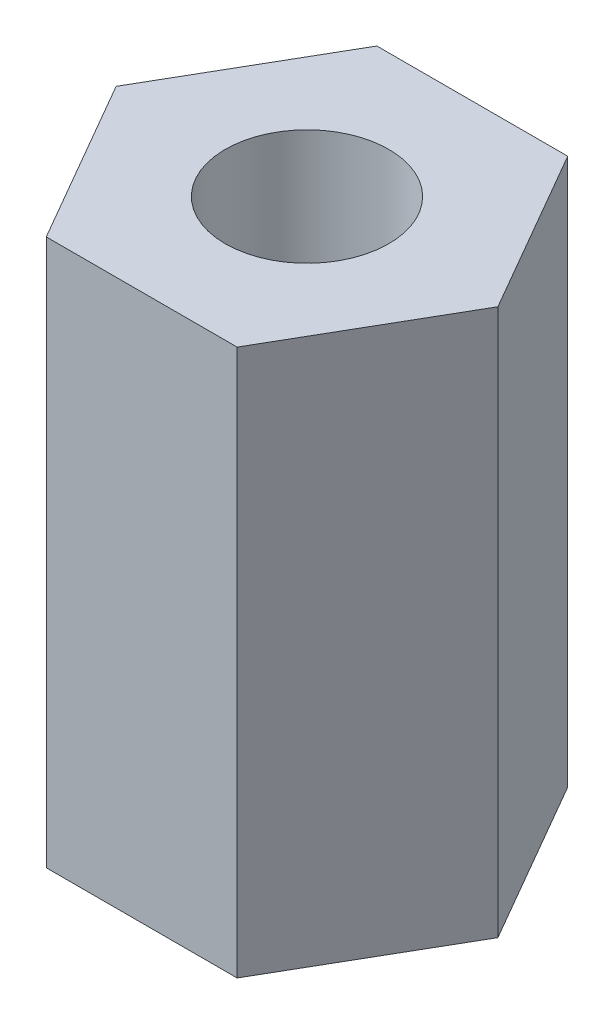
ISO-10303-21;
HEADER;
FILE_DESCRIPTION(('STEP AP214'),'2;1');
FILE_NAME('part.step','',(''),(''),'','','');
FILE_SCHEMA(('AUTOMOTIVE_DESIGN { 1 0 10303 214 1 1 1 1 }'));
ENDSEC;
DATA;
#1=APPLICATION_CONTEXT('core data for automotive mechanical design processes');
#2=APPLICATION_PROTOCOL_DEFINITION('international standard','automotive_design',2000,#1);
#3=PRODUCT_CONTEXT('',#1,'mechanical');
#4=PRODUCT('Part','Part','',(#3));
#5=PRODUCT_RELATED_PRODUCT_CATEGORY('part','',(#4));
#6=PRODUCT_DEFINITION_FORMATION('','',#4);
#7=PRODUCT_DEFINITION_CONTEXT('part definition',#1,'design');
#8=PRODUCT_DEFINITION('design','',#6,#7);
#9=PRODUCT_DEFINITION_SHAPE('','',#8);
#10=(LENGTH_UNIT() NAMED_UNIT(*) SI_UNIT(.MILLI.,.METRE.));
#11=(NAMED_UNIT(*) PLANE_ANGLE_UNIT() SI_UNIT($,.RADIAN.));
#12=(NAMED_UNIT(*) SI_UNIT($,.STERADIAN.) SOLID_ANGLE_UNIT());
#13=UNCERTAINTY_MEASURE_WITH_UNIT(LENGTH_MEASURE(1.E-05),#10,'distance_accuracy_value','');
#14=(GEOMETRIC_REPRESENTATION_CONTEXT(3) GLOBAL_UNCERTAINTY_ASSIGNED_CONTEXT((#13)) GLOBAL_UNIT_ASSIGNED_CONTEXT((#10,
#11,#12)) REPRESENTATION_CONTEXT('',''));
#15=CARTESIAN_POINT('',(0.,0.,0.));
#16=DIRECTION('',(0.,0.,1.));
#17=DIRECTION('',(1.,0.,0.));
#18=AXIS2_PLACEMENT_3D('',#15,#16,#17);
#19=CARTESIAN_POINT('',(0.,9.9695,0.));
#20=DIRECTION('',(0.,1.,0.));
#21=DIRECTION('',(0.,0.,1.));
#22=AXIS2_PLACEMENT_3D('',#19,#20,#21);
#23=PLANE('',#22);
#24=DIRECTION('',(0.5,0.,-0.866025403784439));
#25=VECTOR('',#24,1.);
#26=CARTESIAN_POINT('',(3.48286549888642,9.9695,6.0325));
#27=LINE('',#26,#25);
#28=CARTESIAN_POINT('',(3.48286549888642,9.9695,6.0325));
#29=VERTEX_POINT('',#28);
#30=CARTESIAN_POINT('',(6.96573099777284,9.9695,0.));
#31=VERTEX_POINT('',#30);
#32=EDGE_CURVE('E131',#29,#31,#27,.T.);
#33=ORIENTED_EDGE('',*,*,#32,.T.);
#34=DIRECTION('',(-0.5,0.,-0.866025403784439));
#35=VECTOR('',#34,1.);
#36=CARTESIAN_POINT('',(6.96573099777284,9.9695,0.));
#37=LINE('',#36,#35);
#38=CARTESIAN_POINT('',(3.48286549888642,9.9695,-6.0325));
#39=VERTEX_POINT('',#38);
#40=EDGE_CURVE('E89',#31,#39,#37,.T.);
#41=ORIENTED_EDGE('',*,*,#40,.T.);
#42=DIRECTION('',(-1.,0.,0.));
#43=VECTOR('',#42,1.);
#44=CARTESIAN_POINT('',(3.48286549888642,9.9695,-6.0325));
#45=LINE('',#44,#43);
#46=CARTESIAN_POINT('',(-3.48286549888642,9.9695,-6.0325));
#47=VERTEX_POINT('',#46);
#48=EDGE_CURVE('E102',#39,#47,#45,.T.);
#49=ORIENTED_EDGE('',*,*,#48,.T.);
#50=DIRECTION('',(-0.5,0.,0.866025403784439));
#51=VECTOR('',#50,1.);
#52=CARTESIAN_POINT('',(-3.48286549888642,9.9695,-6.0325));
#53=LINE('',#52,#51);
#54=CARTESIAN_POINT('',(-6.96573099777284,9.9695,0.));
#55=VERTEX_POINT('',#54);
#56=EDGE_CURVE('E96',#47,#55,#53,.T.);
#57=ORIENTED_EDGE('',*,*,#56,.T.);
#58=DIRECTION('',(0.5,0.,0.866025403784439));
#59=VECTOR('',#58,1.);
#60=CARTESIAN_POINT('',(-6.96573099777284,9.9695,0.));
#61=LINE('',#60,#59);
#62=CARTESIAN_POINT('',(-3.48286549888642,9.9695,6.0325));
#63=VERTEX_POINT('',#62);
#64=EDGE_CURVE('E100',#55,#63,#61,.T.);
#65=ORIENTED_EDGE('',*,*,#64,.T.);
#66=DIRECTION('',(1.,0.,0.));
#67=VECTOR('',#66,1.);
#68=CARTESIAN_POINT('',(-3.48286549888642,9.9695,6.0325));
#69=LINE('',#68,#67);
#70=EDGE_CURVE('E52',#63,#29,#69,.T.);
#71=ORIENTED_EDGE('',*,*,#70,.T.);
#72=EDGE_LOOP('',(#33,#41,#49,#57,#65,#71));
#73=FACE_BOUND('',#72,.T.);
#74=CARTESIAN_POINT('',(0.,9.9695,0.));
#75=DIRECTION('',(0.,1.,0.));
#76=DIRECTION('',(0.,0.,1.));
#77=AXIS2_PLACEMENT_3D('',#74,#75,#76);
#78=CIRCLE('',#77,2.9845);
#79=CARTESIAN_POINT('',(0.,9.9695,2.9845));
#80=VERTEX_POINT('',#79);
#81=EDGE_CURVE('E124',#80,#80,#78,.T.);
#82=ORIENTED_EDGE('',*,*,#81,.F.);
#83=EDGE_LOOP('',(#82));
#84=FACE_BOUND('',#83,.T.);
#85=ADVANCED_FACE('F35',(#73,#84),#23,.T.);
#86=CARTESIAN_POINT('',(0.,-9.9695,0.));
#87=DIRECTION('',(0.,1.,0.));
#88=DIRECTION('',(0.,0.,1.));
#89=AXIS2_PLACEMENT_3D('',#86,#87,#88);
#90=PLANE('',#89);
#91=DIRECTION('',(0.5,0.,-0.866025403784439));
#92=VECTOR('',#91,1.);
#93=CARTESIAN_POINT('',(3.48286549888642,-9.9695,6.0325));
#94=LINE('',#93,#92);
#95=CARTESIAN_POINT('',(3.48286549888642,-9.9695,6.0325));
#96=VERTEX_POINT('',#95);
#97=CARTESIAN_POINT('',(6.96573099777284,-9.9695,0.));
#98=VERTEX_POINT('',#97);
#99=EDGE_CURVE('E120',#96,#98,#94,.T.);
#100=ORIENTED_EDGE('',*,*,#99,.F.);
#101=DIRECTION('',(1.,0.,0.));
#102=VECTOR('',#101,1.);
#103=CARTESIAN_POINT('',(-3.48286549888642,-9.9695,6.0325));
#104=LINE('',#103,#102);
#105=CARTESIAN_POINT('',(-3.48286549888642,-9.9695,6.0325));
#106=VERTEX_POINT('',#105);
#107=EDGE_CURVE('E81',#106,#96,#104,.T.);
#108=ORIENTED_EDGE('',*,*,#107,.F.);
#109=DIRECTION('',(0.5,0.,0.866025403784439));
#110=VECTOR('',#109,1.);
#111=CARTESIAN_POINT('',(-6.96573099777284,-9.9695,0.));
#112=LINE('',#111,#110);
#113=CARTESIAN_POINT('',(-6.96573099777284,-9.9695,0.));
#114=VERTEX_POINT('',#113);
#115=EDGE_CURVE('E75',#114,#106,#112,.T.);
#116=ORIENTED_EDGE('',*,*,#115,.F.);
#117=DIRECTION('',(-0.5,0.,0.866025403784439));
#118=VECTOR('',#117,1.);
#119=CARTESIAN_POINT('',(-3.48286549888642,-9.9695,-6.0325));
#120=LINE('',#119,#118);
#121=CARTESIAN_POINT('',(-3.48286549888642,-9.9695,-6.0325));
#122=VERTEX_POINT('',#121);
#123=EDGE_CURVE('E110',#122,#114,#120,.T.);
#124=ORIENTED_EDGE('',*,*,#123,.F.);
#125=DIRECTION('',(-1.,0.,0.));
#126=VECTOR('',#125,1.);
#127=CARTESIAN_POINT('',(3.48286549888642,-9.9695,-6.0325));
#128=LINE('',#127,#126);
#129=CARTESIAN_POINT('',(3.48286549888642,-9.9695,-6.0325));
#130=VERTEX_POINT('',#129);
#131=EDGE_CURVE('E126',#130,#122,#128,.T.);
#132=ORIENTED_EDGE('',*,*,#131,.F.);
#133=DIRECTION('',(-0.5,0.,-0.866025403784439));
#134=VECTOR('',#133,1.);
#135=CARTESIAN_POINT('',(6.96573099777284,-9.9695,0.));
#136=LINE('',#135,#134);
#137=EDGE_CURVE('E123',#98,#130,#136,.T.);
#138=ORIENTED_EDGE('',*,*,#137,.F.);
#139=EDGE_LOOP('',(#100,#108,#116,#124,#132,#138));
#140=FACE_BOUND('',#139,.T.);
#141=CARTESIAN_POINT('',(0.,-9.9695,0.));
#142=DIRECTION('',(0.,1.,0.));
#143=DIRECTION('',(0.,0.,1.));
#144=AXIS2_PLACEMENT_3D('',#141,#142,#143);
#145=CIRCLE('',#144,2.9845);
#146=CARTESIAN_POINT('',(0.,-9.9695,2.9845));
#147=VERTEX_POINT('',#146);
#148=EDGE_CURVE('E224',#147,#147,#145,.T.);
#149=ORIENTED_EDGE('',*,*,#148,.T.);
#150=EDGE_LOOP('',(#149));
#151=FACE_BOUND('',#150,.T.);
#152=ADVANCED_FACE('F140',(#140,#151),#90,.F.);
#153=CARTESIAN_POINT('',(3.48286549888642,9.9695,6.0325));
#154=DIRECTION('',(-0.866025403784438,0.,-0.5));
#155=DIRECTION('',(-0.5,0.,0.866025403784439));
#156=AXIS2_PLACEMENT_3D('',#153,#154,#155);
#157=PLANE('',#156);
#158=ORIENTED_EDGE('',*,*,#99,.T.);
#159=DIRECTION('',(0.,-1.,0.));
#160=VECTOR('',#159,1.);
#161=CARTESIAN_POINT('',(6.96573099777284,9.9695,0.));
#162=LINE('',#161,#160);
#163=EDGE_CURVE('E11',#31,#98,#162,.T.);
#164=ORIENTED_EDGE('',*,*,#163,.F.);
#165=ORIENTED_EDGE('',*,*,#32,.F.);
#166=DIRECTION('',(0.,-1.,0.));
#167=VECTOR('',#166,1.);
#168=CARTESIAN_POINT('',(3.48286549888642,9.9695,6.0325));
#169=LINE('',#168,#167);
#170=EDGE_CURVE('E116',#29,#96,#169,.T.);
#171=ORIENTED_EDGE('',*,*,#170,.T.);
#172=EDGE_LOOP('',(#158,#164,#165,#171));
#173=FACE_BOUND('',#172,.T.);
#174=ADVANCED_FACE('F37',(#173),#157,.F.);
#175=CARTESIAN_POINT('',(6.96573099777284,9.9695,0.));
#176=DIRECTION('',(-0.866025403784439,0.,0.5));
#177=DIRECTION('',(0.5,0.,0.866025403784439));
#178=AXIS2_PLACEMENT_3D('',#175,#176,#177);
#179=PLANE('',#178);
#180=ORIENTED_EDGE('',*,*,#137,.T.);
#181=DIRECTION('',(0.,-1.,0.));
#182=VECTOR('',#181,1.);
#183=CARTESIAN_POINT('',(3.48286549888642,9.9695,-6.0325));
#184=LINE('',#183,#182);
#185=EDGE_CURVE('E44',#39,#130,#184,.T.);
#186=ORIENTED_EDGE('',*,*,#185,.F.);
#187=ORIENTED_EDGE('',*,*,#40,.F.);
#188=ORIENTED_EDGE('',*,*,#163,.T.);
#189=EDGE_LOOP('',(#180,#186,#187,#188));
#190=FACE_BOUND('',#189,.T.);
#191=ADVANCED_FACE('F165',(#190),#179,.F.);
#192=CARTESIAN_POINT('',(3.48286549888642,9.9695,-6.0325));
#193=DIRECTION('',(0.,0.,1.));
#194=DIRECTION('',(1.,0.,0.));
#195=AXIS2_PLACEMENT_3D('',#192,#193,#194);
#196=PLANE('',#195);
#197=ORIENTED_EDGE('',*,*,#131,.T.);
#198=DIRECTION('',(0.,-1.,0.));
#199=VECTOR('',#198,1.);
#200=CARTESIAN_POINT('',(-3.48286549888642,9.9695,-6.0325));
#201=LINE('',#200,#199);
#202=EDGE_CURVE('E111',#47,#122,#201,.T.);
#203=ORIENTED_EDGE('',*,*,#202,.F.);
#204=ORIENTED_EDGE('',*,*,#48,.F.);
#205=ORIENTED_EDGE('',*,*,#185,.T.);
#206=EDGE_LOOP('',(#197,#203,#204,#205));
#207=FACE_BOUND('',#206,.T.);
#208=ADVANCED_FACE('F137',(#207),#196,.F.);
#209=CARTESIAN_POINT('',(-3.48286549888642,9.9695,-6.0325));
#210=DIRECTION('',(0.866025403784439,0.,0.5));
#211=DIRECTION('',(0.5,0.,-0.866025403784439));
#212=AXIS2_PLACEMENT_3D('',#209,#210,#211);
#213=PLANE('',#212);
#214=ORIENTED_EDGE('',*,*,#123,.T.);
#215=DIRECTION('',(0.,-1.,0.));
#216=VECTOR('',#215,1.);
#217=CARTESIAN_POINT('',(-6.96573099777284,9.9695,0.));
#218=LINE('',#217,#216);
#219=EDGE_CURVE('E107',#55,#114,#218,.T.);
#220=ORIENTED_EDGE('',*,*,#219,.F.);
#221=ORIENTED_EDGE('',*,*,#56,.F.);
#222=ORIENTED_EDGE('',*,*,#202,.T.);
#223=EDGE_LOOP('',(#214,#220,#221,#222));
#224=FACE_BOUND('',#223,.T.);
#225=ADVANCED_FACE('F108',(#224),#213,.F.);
#226=CARTESIAN_POINT('',(-6.96573099777284,9.9695,0.));
#227=DIRECTION('',(0.866025403784439,0.,-0.5));
#228=DIRECTION('',(-0.5,0.,-0.866025403784439));
#229=AXIS2_PLACEMENT_3D('',#226,#227,#228);
#230=PLANE('',#229);
#231=ORIENTED_EDGE('',*,*,#115,.T.);
#232=DIRECTION('',(0.,-1.,0.));
#233=VECTOR('',#232,1.);
#234=CARTESIAN_POINT('',(-3.48286549888642,9.9695,6.0325));
#235=LINE('',#234,#233);
#236=EDGE_CURVE('E112',#63,#106,#235,.T.);
#237=ORIENTED_EDGE('',*,*,#236,.F.);
#238=ORIENTED_EDGE('',*,*,#64,.F.);
#239=ORIENTED_EDGE('',*,*,#219,.T.);
#240=EDGE_LOOP('',(#231,#237,#238,#239));
#241=FACE_BOUND('',#240,.T.);
#242=ADVANCED_FACE('F114',(#241),#230,.F.);
#243=CARTESIAN_POINT('',(-3.48286549888642,9.9695,6.0325));
#244=DIRECTION('',(0.,0.,-1.));
#245=DIRECTION('',(-1.,0.,0.));
#246=AXIS2_PLACEMENT_3D('',#243,#244,#245);
#247=PLANE('',#246);
#248=ORIENTED_EDGE('',*,*,#107,.T.);
#249=ORIENTED_EDGE('',*,*,#170,.F.);
#250=ORIENTED_EDGE('',*,*,#70,.F.);
#251=ORIENTED_EDGE('',*,*,#236,.T.);
#252=EDGE_LOOP('',(#248,#249,#250,#251));
#253=FACE_BOUND('',#252,.T.);
#254=ADVANCED_FACE('F145',(#253),#247,.F.);
#255=CARTESIAN_POINT('',(0.,9.9695,0.));
#256=DIRECTION('',(0.,-1.,0.));
#257=DIRECTION('',(0.,0.,-1.));
#258=AXIS2_PLACEMENT_3D('',#255,#256,#257);
#259=CYLINDRICAL_SURFACE('',#258,2.9845);
#260=ORIENTED_EDGE('',*,*,#81,.T.);
#261=EDGE_LOOP('',(#260));
#262=FACE_BOUND('',#261,.T.);
#263=ORIENTED_EDGE('',*,*,#148,.F.);
#264=EDGE_LOOP('',(#263));
#265=FACE_BOUND('',#264,.T.);
#266=ADVANCED_FACE('F147',(#262,#265),#259,.F.);
#267=CLOSED_SHELL('',(#85,#152,#174,#191,#208,#225,#242,#254,#266));
#268=MANIFOLD_SOLID_BREP('B2',#267);
#269=ADVANCED_BREP_SHAPE_REPRESENTATION('',(#18,#268),#14);
#270=SHAPE_DEFINITION_REPRESENTATION(#9,#269);
ENDSEC;
END-ISO-10303-21;
